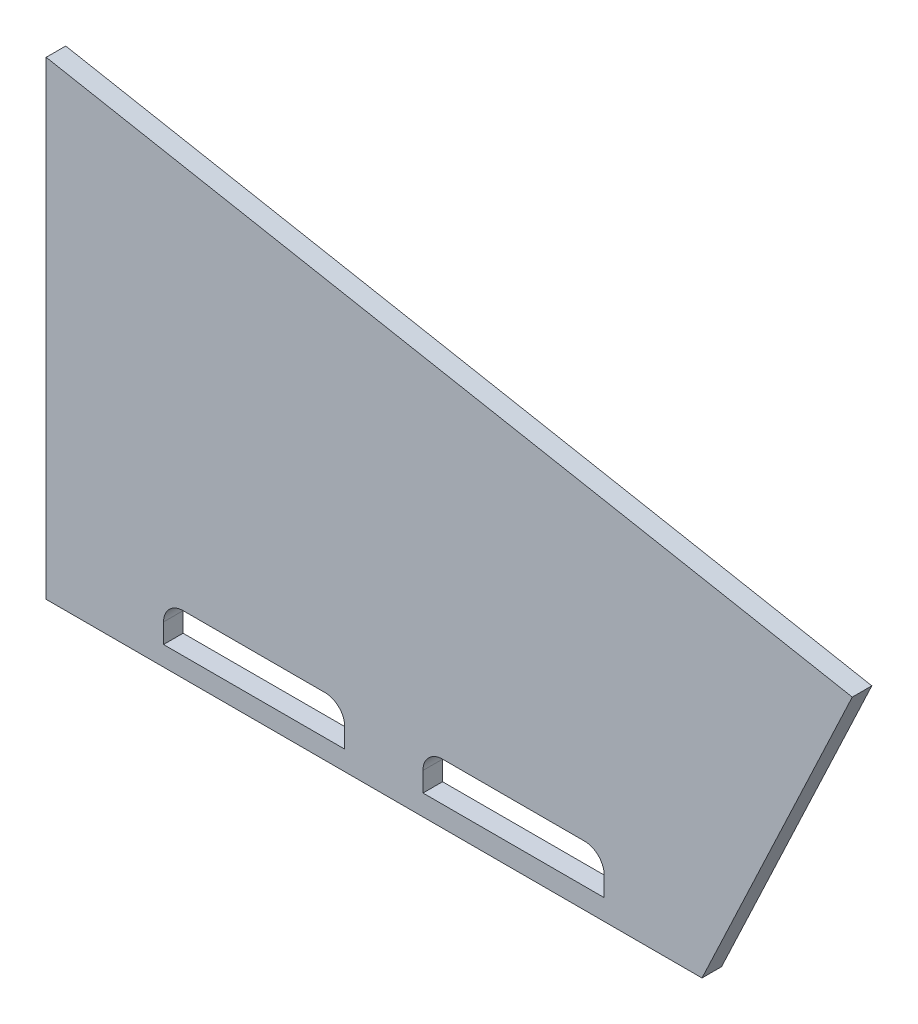
ISO-10303-21;
HEADER;
FILE_DESCRIPTION(('STEP AP214'),'2;1');
FILE_NAME('part.step','',(''),(''),'','','');
FILE_SCHEMA(('AUTOMOTIVE_DESIGN { 1 0 10303 214 1 1 1 1 }'));
ENDSEC;
DATA;
#1=APPLICATION_CONTEXT('core data for automotive mechanical design processes');
#2=APPLICATION_PROTOCOL_DEFINITION('international standard','automotive_design',2000,#1);
#3=PRODUCT_CONTEXT('',#1,'mechanical');
#4=PRODUCT('Part','Part','',(#3));
#5=PRODUCT_RELATED_PRODUCT_CATEGORY('part','',(#4));
#6=PRODUCT_DEFINITION_FORMATION('','',#4);
#7=PRODUCT_DEFINITION_CONTEXT('part definition',#1,'design');
#8=PRODUCT_DEFINITION('design','',#6,#7);
#9=PRODUCT_DEFINITION_SHAPE('','',#8);
#10=(LENGTH_UNIT() NAMED_UNIT(*) SI_UNIT(.MILLI.,.METRE.));
#11=(NAMED_UNIT(*) PLANE_ANGLE_UNIT() SI_UNIT($,.RADIAN.));
#12=(NAMED_UNIT(*) SI_UNIT($,.STERADIAN.) SOLID_ANGLE_UNIT());
#13=UNCERTAINTY_MEASURE_WITH_UNIT(LENGTH_MEASURE(1.E-05),#10,'distance_accuracy_value','');
#14=(GEOMETRIC_REPRESENTATION_CONTEXT(3) GLOBAL_UNCERTAINTY_ASSIGNED_CONTEXT((#13)) GLOBAL_UNIT_ASSIGNED_CONTEXT((#10,
#11,#12)) REPRESENTATION_CONTEXT('',''));
#15=CARTESIAN_POINT('',(0.,0.,0.));
#16=DIRECTION('',(0.,0.,1.));
#17=DIRECTION('',(1.,0.,0.));
#18=AXIS2_PLACEMENT_3D('',#15,#16,#17);
#19=CARTESIAN_POINT('',(12.7,22.225,-12.7));
#20=DIRECTION('',(0.,-1.,0.));
#21=DIRECTION('',(1.,0.,0.));
#22=AXIS2_PLACEMENT_3D('',#19,#20,#21);
#23=PLANE('',#22);
#24=DIRECTION('',(1.,0.,0.));
#25=VECTOR('',#24,1.);
#26=CARTESIAN_POINT('',(12.7,22.225,0.));
#27=LINE('',#26,#25);
#28=CARTESIAN_POINT('',(12.7,22.225,0.));
#29=VERTEX_POINT('',#28);
#30=CARTESIAN_POINT('',(438.521287640416,22.2250000000001,0.));
#31=VERTEX_POINT('',#30);
#32=EDGE_CURVE('E184',#29,#31,#27,.T.);
#33=ORIENTED_EDGE('',*,*,#32,.F.);
#34=DIRECTION('',(0.,0.,1.));
#35=VECTOR('',#34,1.);
#36=CARTESIAN_POINT('',(12.7,22.225,-12.7));
#37=LINE('',#36,#35);
#38=CARTESIAN_POINT('',(12.7,22.225,-12.7));
#39=VERTEX_POINT('',#38);
#40=EDGE_CURVE('E236',#39,#29,#37,.T.);
#41=ORIENTED_EDGE('',*,*,#40,.F.);
#42=DIRECTION('',(1.,0.,0.));
#43=VECTOR('',#42,1.);
#44=CARTESIAN_POINT('',(12.7,22.225,-12.7));
#45=LINE('',#44,#43);
#46=CARTESIAN_POINT('',(438.521287640416,22.2250000000001,-12.7));
#47=VERTEX_POINT('',#46);
#48=EDGE_CURVE('E212',#39,#47,#45,.T.);
#49=ORIENTED_EDGE('',*,*,#48,.T.);
#50=DIRECTION('',(0.,0.,1.));
#51=VECTOR('',#50,1.);
#52=CARTESIAN_POINT('',(438.521287640416,22.2250000000001,-12.7));
#53=LINE('',#52,#51);
#54=EDGE_CURVE('E225',#47,#31,#53,.T.);
#55=ORIENTED_EDGE('',*,*,#54,.T.);
#56=EDGE_LOOP('',(#33,#41,#49,#55));
#57=FACE_BOUND('',#56,.T.);
#58=ADVANCED_FACE('F37',(#57),#23,.T.);
#59=CARTESIAN_POINT('',(12.7,22.225,-12.7));
#60=DIRECTION('',(-1.,0.,0.));
#61=DIRECTION('',(0.,-1.,0.));
#62=AXIS2_PLACEMENT_3D('',#59,#60,#61);
#63=PLANE('',#62);
#64=DIRECTION('',(0.,-1.,0.));
#65=VECTOR('',#64,1.);
#66=CARTESIAN_POINT('',(12.7,22.225,0.));
#67=LINE('',#66,#65);
#68=CARTESIAN_POINT('',(12.7,327.024999999999,0.));
#69=VERTEX_POINT('',#68);
#70=EDGE_CURVE('E216',#69,#29,#67,.T.);
#71=ORIENTED_EDGE('',*,*,#70,.F.);
#72=DIRECTION('',(0.,0.,1.));
#73=VECTOR('',#72,1.);
#74=CARTESIAN_POINT('',(12.7,327.024999999999,-12.7));
#75=LINE('',#74,#73);
#76=CARTESIAN_POINT('',(12.7,327.024999999999,-12.7));
#77=VERTEX_POINT('',#76);
#78=EDGE_CURVE('E239',#77,#69,#75,.T.);
#79=ORIENTED_EDGE('',*,*,#78,.F.);
#80=DIRECTION('',(0.,-1.,0.));
#81=VECTOR('',#80,1.);
#82=CARTESIAN_POINT('',(12.7,22.225,-12.7));
#83=LINE('',#82,#81);
#84=EDGE_CURVE('E222',#77,#39,#83,.T.);
#85=ORIENTED_EDGE('',*,*,#84,.T.);
#86=ORIENTED_EDGE('',*,*,#40,.T.);
#87=EDGE_LOOP('',(#71,#79,#85,#86));
#88=FACE_BOUND('',#87,.T.);
#89=ADVANCED_FACE('F289',(#88),#63,.T.);
#90=CARTESIAN_POINT('',(12.7,327.024999999999,-12.7));
#91=DIRECTION('',(0.184164932559248,0.982895354356428,0.));
#92=DIRECTION('',(-0.982895354356428,0.184164932559248,0.));
#93=AXIS2_PLACEMENT_3D('',#90,#91,#92);
#94=PLANE('',#93);
#95=DIRECTION('',(-0.982895354356428,0.184164932559248,0.));
#96=VECTOR('',#95,1.);
#97=CARTESIAN_POINT('',(12.7,327.024999999999,0.));
#98=LINE('',#97,#96);
#99=CARTESIAN_POINT('',(536.089806584638,228.957542457714,0.));
#100=VERTEX_POINT('',#99);
#101=EDGE_CURVE('E231',#100,#69,#98,.T.);
#102=ORIENTED_EDGE('',*,*,#101,.F.);
#103=DIRECTION('',(0.,0.,1.));
#104=VECTOR('',#103,1.);
#105=CARTESIAN_POINT('',(536.089806584638,228.957542457714,-12.7));
#106=LINE('',#105,#104);
#107=CARTESIAN_POINT('',(536.089806584638,228.957542457714,-12.7));
#108=VERTEX_POINT('',#107);
#109=EDGE_CURVE('E241',#108,#100,#106,.T.);
#110=ORIENTED_EDGE('',*,*,#109,.F.);
#111=DIRECTION('',(-0.982895354356428,0.184164932559248,0.));
#112=VECTOR('',#111,1.);
#113=CARTESIAN_POINT('',(12.7,327.024999999999,-12.7));
#114=LINE('',#113,#112);
#115=EDGE_CURVE('E219',#108,#77,#114,.T.);
#116=ORIENTED_EDGE('',*,*,#115,.T.);
#117=ORIENTED_EDGE('',*,*,#78,.T.);
#118=EDGE_LOOP('',(#102,#110,#116,#117));
#119=FACE_BOUND('',#118,.T.);
#120=ADVANCED_FACE('F295',(#119),#94,.T.);
#121=CARTESIAN_POINT('',(438.521287640416,22.2250000000001,-12.7));
#122=DIRECTION('',(0.904341830523688,-0.426808919266064,0.));
#123=DIRECTION('',(0.426808919266064,0.904341830523688,0.));
#124=AXIS2_PLACEMENT_3D('',#121,#122,#123);
#125=PLANE('',#124);
#126=DIRECTION('',(0.426808919266064,0.904341830523688,0.));
#127=VECTOR('',#126,1.);
#128=CARTESIAN_POINT('',(438.521287640416,22.2250000000001,0.));
#129=LINE('',#128,#127);
#130=EDGE_CURVE('E228',#31,#100,#129,.T.);
#131=ORIENTED_EDGE('',*,*,#130,.F.);
#132=ORIENTED_EDGE('',*,*,#54,.F.);
#133=DIRECTION('',(0.426808919266064,0.904341830523688,0.));
#134=VECTOR('',#133,1.);
#135=CARTESIAN_POINT('',(438.521287640416,22.2250000000001,-12.7));
#136=LINE('',#135,#134);
#137=EDGE_CURVE('E215',#47,#108,#136,.T.);
#138=ORIENTED_EDGE('',*,*,#137,.T.);
#139=ORIENTED_EDGE('',*,*,#109,.T.);
#140=EDGE_LOOP('',(#131,#132,#138,#139));
#141=FACE_BOUND('',#140,.T.);
#142=ADVANCED_FACE('F301',(#141),#125,.T.);
#143=CARTESIAN_POINT('',(0.,0.,-12.7));
#144=DIRECTION('',(0.,0.,1.));
#145=DIRECTION('',(1.,0.,0.));
#146=AXIS2_PLACEMENT_3D('',#143,#144,#145);
#147=PLANE('',#146);
#148=DIRECTION('',(0.,1.,0.));
#149=VECTOR('',#148,1.);
#150=CARTESIAN_POINT('',(206.560643820208,34.925,-12.7));
#151=LINE('',#150,#149);
#152=CARTESIAN_POINT('',(206.560643820208,34.925,-12.7));
#153=VERTEX_POINT('',#152);
#154=CARTESIAN_POINT('',(206.560643820208,47.625,-12.7));
#155=VERTEX_POINT('',#154);
#156=EDGE_CURVE('E170',#153,#155,#151,.T.);
#157=ORIENTED_EDGE('',*,*,#156,.T.);
#158=CARTESIAN_POINT('',(193.860643820208,47.625,-12.7));
#159=DIRECTION('',(0.,0.,1.));
#160=DIRECTION('',(1.,0.,0.));
#161=AXIS2_PLACEMENT_3D('',#158,#159,#160);
#162=CIRCLE('',#161,12.7);
#163=CARTESIAN_POINT('',(193.860643820208,60.325,-12.7));
#164=VERTEX_POINT('',#163);
#165=EDGE_CURVE('E272',#155,#164,#162,.T.);
#166=ORIENTED_EDGE('',*,*,#165,.T.);
#167=DIRECTION('',(-1.,0.,0.));
#168=VECTOR('',#167,1.);
#169=CARTESIAN_POINT('',(88.9,60.325,-12.7));
#170=LINE('',#169,#168);
#171=CARTESIAN_POINT('',(101.6,60.325,-12.7));
#172=VERTEX_POINT('',#171);
#173=EDGE_CURVE('E166',#164,#172,#170,.T.);
#174=ORIENTED_EDGE('',*,*,#173,.T.);
#175=CARTESIAN_POINT('',(101.6,47.625,-12.7));
#176=DIRECTION('',(0.,0.,1.));
#177=DIRECTION('',(1.,0.,0.));
#178=AXIS2_PLACEMENT_3D('',#175,#176,#177);
#179=CIRCLE('',#178,12.7);
#180=CARTESIAN_POINT('',(88.9,47.625,-12.7));
#181=VERTEX_POINT('',#180);
#182=EDGE_CURVE('E11',#172,#181,#179,.T.);
#183=ORIENTED_EDGE('',*,*,#182,.T.);
#184=DIRECTION('',(0.,-1.,0.));
#185=VECTOR('',#184,1.);
#186=CARTESIAN_POINT('',(88.9,34.925,-12.7));
#187=LINE('',#186,#185);
#188=CARTESIAN_POINT('',(88.9,34.925,-12.7));
#189=VERTEX_POINT('',#188);
#190=EDGE_CURVE('E147',#181,#189,#187,.T.);
#191=ORIENTED_EDGE('',*,*,#190,.T.);
#192=DIRECTION('',(1.,0.,0.));
#193=VECTOR('',#192,1.);
#194=CARTESIAN_POINT('',(88.9,34.925,-12.7));
#195=LINE('',#194,#193);
#196=EDGE_CURVE('E153',#189,#153,#195,.T.);
#197=ORIENTED_EDGE('',*,*,#196,.T.);
#198=EDGE_LOOP('',(#157,#166,#174,#183,#191,#197));
#199=FACE_BOUND('',#198,.T.);
#200=DIRECTION('',(0.,1.,0.));
#201=VECTOR('',#200,1.);
#202=CARTESIAN_POINT('',(375.021287640416,35.6556871069854,-12.7));
#203=LINE('',#202,#201);
#204=CARTESIAN_POINT('',(375.021287640416,35.6556871069854,-12.7));
#205=VERTEX_POINT('',#204);
#206=CARTESIAN_POINT('',(375.021287640416,48.3556871069854,-12.7));
#207=VERTEX_POINT('',#206);
#208=EDGE_CURVE('E205',#205,#207,#203,.T.);
#209=ORIENTED_EDGE('',*,*,#208,.T.);
#210=CARTESIAN_POINT('',(362.321287640416,48.3556871069854,-12.7));
#211=DIRECTION('',(0.,0.,1.));
#212=DIRECTION('',(1.,0.,0.));
#213=AXIS2_PLACEMENT_3D('',#210,#211,#212);
#214=CIRCLE('',#213,12.7);
#215=CARTESIAN_POINT('',(362.321287640416,61.0556871069854,-12.7));
#216=VERTEX_POINT('',#215);
#217=EDGE_CURVE('E264',#207,#216,#214,.T.);
#218=ORIENTED_EDGE('',*,*,#217,.T.);
#219=DIRECTION('',(-1.,0.,0.));
#220=VECTOR('',#219,1.);
#221=CARTESIAN_POINT('',(257.360643820208,61.0556871069854,-12.7));
#222=LINE('',#221,#220);
#223=CARTESIAN_POINT('',(270.060643820208,61.0556871069854,-12.7));
#224=VERTEX_POINT('',#223);
#225=EDGE_CURVE('E189',#216,#224,#222,.T.);
#226=ORIENTED_EDGE('',*,*,#225,.T.);
#227=CARTESIAN_POINT('',(270.060643820208,48.3556871069854,-12.7));
#228=DIRECTION('',(0.,0.,1.));
#229=DIRECTION('',(1.,0.,0.));
#230=AXIS2_PLACEMENT_3D('',#227,#228,#229);
#231=CIRCLE('',#230,12.7);
#232=CARTESIAN_POINT('',(257.360643820208,48.3556871069854,-12.7));
#233=VERTEX_POINT('',#232);
#234=EDGE_CURVE('E268',#224,#233,#231,.T.);
#235=ORIENTED_EDGE('',*,*,#234,.T.);
#236=DIRECTION('',(0.,-1.,0.));
#237=VECTOR('',#236,1.);
#238=CARTESIAN_POINT('',(257.360643820208,35.6556871069854,-12.7));
#239=LINE('',#238,#237);
#240=CARTESIAN_POINT('',(257.360643820208,35.6556871069854,-12.7));
#241=VERTEX_POINT('',#240);
#242=EDGE_CURVE('E196',#233,#241,#239,.T.);
#243=ORIENTED_EDGE('',*,*,#242,.T.);
#244=DIRECTION('',(1.,0.,0.));
#245=VECTOR('',#244,1.);
#246=CARTESIAN_POINT('',(257.360643820208,35.6556871069854,-12.7));
#247=LINE('',#246,#245);
#248=EDGE_CURVE('E208',#241,#205,#247,.T.);
#249=ORIENTED_EDGE('',*,*,#248,.T.);
#250=EDGE_LOOP('',(#209,#218,#226,#235,#243,#249));
#251=FACE_BOUND('',#250,.T.);
#252=ORIENTED_EDGE('',*,*,#48,.F.);
#253=ORIENTED_EDGE('',*,*,#84,.F.);
#254=ORIENTED_EDGE('',*,*,#115,.F.);
#255=ORIENTED_EDGE('',*,*,#137,.F.);
#256=EDGE_LOOP('',(#252,#253,#254,#255));
#257=FACE_BOUND('',#256,.T.);
#258=ADVANCED_FACE('F150',(#199,#251,#257),#147,.F.);
#259=CARTESIAN_POINT('',(0.,0.,0.));
#260=DIRECTION('',(0.,0.,1.));
#261=DIRECTION('',(1.,0.,0.));
#262=AXIS2_PLACEMENT_3D('',#259,#260,#261);
#263=PLANE('',#262);
#264=DIRECTION('',(0.,-1.,0.));
#265=VECTOR('',#264,1.);
#266=CARTESIAN_POINT('',(88.9,34.925,0.));
#267=LINE('',#266,#265);
#268=CARTESIAN_POINT('',(88.9,47.625,0.));
#269=VERTEX_POINT('',#268);
#270=CARTESIAN_POINT('',(88.9,34.925,0.));
#271=VERTEX_POINT('',#270);
#272=EDGE_CURVE('E161',#269,#271,#267,.T.);
#273=ORIENTED_EDGE('',*,*,#272,.F.);
#274=CARTESIAN_POINT('',(101.6,47.625,0.));
#275=DIRECTION('',(0.,0.,1.));
#276=DIRECTION('',(1.,0.,0.));
#277=AXIS2_PLACEMENT_3D('',#274,#275,#276);
#278=CIRCLE('',#277,12.7);
#279=CARTESIAN_POINT('',(101.6,60.325,0.));
#280=VERTEX_POINT('',#279);
#281=EDGE_CURVE('E45',#269,#280,#278,.F.);
#282=ORIENTED_EDGE('',*,*,#281,.T.);
#283=DIRECTION('',(-1.,0.,0.));
#284=VECTOR('',#283,1.);
#285=CARTESIAN_POINT('',(88.9,60.325,0.));
#286=LINE('',#285,#284);
#287=CARTESIAN_POINT('',(193.860643820208,60.325,0.));
#288=VERTEX_POINT('',#287);
#289=EDGE_CURVE('E155',#288,#280,#286,.T.);
#290=ORIENTED_EDGE('',*,*,#289,.F.);
#291=CARTESIAN_POINT('',(193.860643820208,47.625,0.));
#292=DIRECTION('',(0.,0.,1.));
#293=DIRECTION('',(1.,0.,0.));
#294=AXIS2_PLACEMENT_3D('',#291,#292,#293);
#295=CIRCLE('',#294,12.7);
#296=CARTESIAN_POINT('',(206.560643820208,47.625,0.));
#297=VERTEX_POINT('',#296);
#298=EDGE_CURVE('E270',#288,#297,#295,.F.);
#299=ORIENTED_EDGE('',*,*,#298,.T.);
#300=DIRECTION('',(0.,1.,0.));
#301=VECTOR('',#300,1.);
#302=CARTESIAN_POINT('',(206.560643820208,34.925,0.));
#303=LINE('',#302,#301);
#304=CARTESIAN_POINT('',(206.560643820208,34.925,0.));
#305=VERTEX_POINT('',#304);
#306=EDGE_CURVE('E179',#305,#297,#303,.T.);
#307=ORIENTED_EDGE('',*,*,#306,.F.);
#308=DIRECTION('',(1.,0.,0.));
#309=VECTOR('',#308,1.);
#310=CARTESIAN_POINT('',(88.9,34.925,0.));
#311=LINE('',#310,#309);
#312=EDGE_CURVE('E176',#271,#305,#311,.T.);
#313=ORIENTED_EDGE('',*,*,#312,.F.);
#314=EDGE_LOOP('',(#273,#282,#290,#299,#307,#313));
#315=FACE_BOUND('',#314,.T.);
#316=DIRECTION('',(0.,-1.,0.));
#317=VECTOR('',#316,1.);
#318=CARTESIAN_POINT('',(257.360643820208,35.6556871069854,0.));
#319=LINE('',#318,#317);
#320=CARTESIAN_POINT('',(257.360643820208,48.3556871069854,0.));
#321=VERTEX_POINT('',#320);
#322=CARTESIAN_POINT('',(257.360643820208,35.6556871069854,0.));
#323=VERTEX_POINT('',#322);
#324=EDGE_CURVE('E177',#321,#323,#319,.T.);
#325=ORIENTED_EDGE('',*,*,#324,.F.);
#326=CARTESIAN_POINT('',(270.060643820208,48.3556871069854,0.));
#327=DIRECTION('',(0.,0.,1.));
#328=DIRECTION('',(1.,0.,0.));
#329=AXIS2_PLACEMENT_3D('',#326,#327,#328);
#330=CIRCLE('',#329,12.7);
#331=CARTESIAN_POINT('',(270.060643820208,61.0556871069854,0.));
#332=VERTEX_POINT('',#331);
#333=EDGE_CURVE('E266',#321,#332,#330,.F.);
#334=ORIENTED_EDGE('',*,*,#333,.T.);
#335=DIRECTION('',(-1.,0.,0.));
#336=VECTOR('',#335,1.);
#337=CARTESIAN_POINT('',(257.360643820208,61.0556871069854,0.));
#338=LINE('',#337,#336);
#339=CARTESIAN_POINT('',(362.321287640416,61.0556871069854,0.));
#340=VERTEX_POINT('',#339);
#341=EDGE_CURVE('E192',#340,#332,#338,.T.);
#342=ORIENTED_EDGE('',*,*,#341,.F.);
#343=CARTESIAN_POINT('',(362.321287640416,48.3556871069854,0.));
#344=DIRECTION('',(0.,0.,1.));
#345=DIRECTION('',(1.,0.,0.));
#346=AXIS2_PLACEMENT_3D('',#343,#344,#345);
#347=CIRCLE('',#346,12.7);
#348=CARTESIAN_POINT('',(375.021287640416,48.3556871069854,0.));
#349=VERTEX_POINT('',#348);
#350=EDGE_CURVE('E262',#340,#349,#347,.F.);
#351=ORIENTED_EDGE('',*,*,#350,.T.);
#352=DIRECTION('',(0.,1.,0.));
#353=VECTOR('',#352,1.);
#354=CARTESIAN_POINT('',(375.021287640416,35.6556871069854,0.));
#355=LINE('',#354,#353);
#356=CARTESIAN_POINT('',(375.021287640416,35.6556871069854,0.));
#357=VERTEX_POINT('',#356);
#358=EDGE_CURVE('E195',#357,#349,#355,.T.);
#359=ORIENTED_EDGE('',*,*,#358,.F.);
#360=DIRECTION('',(1.,0.,0.));
#361=VECTOR('',#360,1.);
#362=CARTESIAN_POINT('',(257.360643820208,35.6556871069854,0.));
#363=LINE('',#362,#361);
#364=EDGE_CURVE('E199',#323,#357,#363,.T.);
#365=ORIENTED_EDGE('',*,*,#364,.F.);
#366=EDGE_LOOP('',(#325,#334,#342,#351,#359,#365));
#367=FACE_BOUND('',#366,.T.);
#368=ORIENTED_EDGE('',*,*,#32,.T.);
#369=ORIENTED_EDGE('',*,*,#130,.T.);
#370=ORIENTED_EDGE('',*,*,#101,.T.);
#371=ORIENTED_EDGE('',*,*,#70,.T.);
#372=EDGE_LOOP('',(#368,#369,#370,#371));
#373=FACE_BOUND('',#372,.T.);
#374=ADVANCED_FACE('F275',(#315,#367,#373),#263,.T.);
#375=CARTESIAN_POINT('',(257.360643820208,35.6556871069854,-12.7));
#376=DIRECTION('',(-1.,0.,0.));
#377=DIRECTION('',(0.,0.,1.));
#378=AXIS2_PLACEMENT_3D('',#375,#376,#377);
#379=PLANE('',#378);
#380=ORIENTED_EDGE('',*,*,#242,.F.);
#381=DIRECTION('',(0.,0.,1.));
#382=VECTOR('',#381,1.);
#383=CARTESIAN_POINT('',(257.360643820208,48.3556871069854,0.));
#384=LINE('',#383,#382);
#385=EDGE_CURVE('E250',#233,#321,#384,.T.);
#386=ORIENTED_EDGE('',*,*,#385,.T.);
#387=ORIENTED_EDGE('',*,*,#324,.T.);
#388=DIRECTION('',(0.,0.,1.));
#389=VECTOR('',#388,1.);
#390=CARTESIAN_POINT('',(257.360643820208,35.6556871069854,-12.7));
#391=LINE('',#390,#389);
#392=EDGE_CURVE('E186',#241,#323,#391,.T.);
#393=ORIENTED_EDGE('',*,*,#392,.F.);
#394=EDGE_LOOP('',(#380,#386,#387,#393));
#395=FACE_BOUND('',#394,.T.);
#396=ADVANCED_FACE('F319',(#395),#379,.F.);
#397=CARTESIAN_POINT('',(257.360643820208,61.0556871069854,-12.7));
#398=DIRECTION('',(0.,1.,0.));
#399=DIRECTION('',(0.,0.,1.));
#400=AXIS2_PLACEMENT_3D('',#397,#398,#399);
#401=PLANE('',#400);
#402=ORIENTED_EDGE('',*,*,#225,.F.);
#403=DIRECTION('',(0.,0.,1.));
#404=VECTOR('',#403,1.);
#405=CARTESIAN_POINT('',(362.321287640416,61.0556871069854,0.));
#406=LINE('',#405,#404);
#407=EDGE_CURVE('E245',#216,#340,#406,.T.);
#408=ORIENTED_EDGE('',*,*,#407,.T.);
#409=ORIENTED_EDGE('',*,*,#341,.T.);
#410=DIRECTION('',(0.,0.,1.));
#411=VECTOR('',#410,1.);
#412=CARTESIAN_POINT('',(270.060643820208,61.0556871069854,-12.7));
#413=LINE('',#412,#411);
#414=EDGE_CURVE('E238',#332,#224,#413,.F.);
#415=ORIENTED_EDGE('',*,*,#414,.T.);
#416=EDGE_LOOP('',(#402,#408,#409,#415));
#417=FACE_BOUND('',#416,.T.);
#418=ADVANCED_FACE('F332',(#417),#401,.F.);
#419=CARTESIAN_POINT('',(375.021287640416,35.6556871069854,-12.7));
#420=DIRECTION('',(1.,0.,0.));
#421=DIRECTION('',(0.,0.,-1.));
#422=AXIS2_PLACEMENT_3D('',#419,#420,#421);
#423=PLANE('',#422);
#424=ORIENTED_EDGE('',*,*,#358,.T.);
#425=DIRECTION('',(0.,0.,1.));
#426=VECTOR('',#425,1.);
#427=CARTESIAN_POINT('',(375.021287640416,48.3556871069854,-12.7));
#428=LINE('',#427,#426);
#429=EDGE_CURVE('E248',#349,#207,#428,.F.);
#430=ORIENTED_EDGE('',*,*,#429,.T.);
#431=ORIENTED_EDGE('',*,*,#208,.F.);
#432=DIRECTION('',(0.,0.,1.));
#433=VECTOR('',#432,1.);
#434=CARTESIAN_POINT('',(375.021287640416,35.6556871069854,-12.7));
#435=LINE('',#434,#433);
#436=EDGE_CURVE('E190',#205,#357,#435,.T.);
#437=ORIENTED_EDGE('',*,*,#436,.T.);
#438=EDGE_LOOP('',(#424,#430,#431,#437));
#439=FACE_BOUND('',#438,.T.);
#440=ADVANCED_FACE('F335',(#439),#423,.F.);
#441=CARTESIAN_POINT('',(257.360643820208,35.6556871069854,-12.7));
#442=DIRECTION('',(0.,-1.,0.));
#443=DIRECTION('',(0.,0.,-1.));
#444=AXIS2_PLACEMENT_3D('',#441,#442,#443);
#445=PLANE('',#444);
#446=ORIENTED_EDGE('',*,*,#364,.T.);
#447=ORIENTED_EDGE('',*,*,#436,.F.);
#448=ORIENTED_EDGE('',*,*,#248,.F.);
#449=ORIENTED_EDGE('',*,*,#392,.T.);
#450=EDGE_LOOP('',(#446,#447,#448,#449));
#451=FACE_BOUND('',#450,.T.);
#452=ADVANCED_FACE('F325',(#451),#445,.F.);
#453=CARTESIAN_POINT('',(88.9,34.925,-12.7));
#454=DIRECTION('',(-1.,0.,0.));
#455=DIRECTION('',(0.,0.,1.));
#456=AXIS2_PLACEMENT_3D('',#453,#454,#455);
#457=PLANE('',#456);
#458=ORIENTED_EDGE('',*,*,#190,.F.);
#459=DIRECTION('',(0.,0.,1.));
#460=VECTOR('',#459,1.);
#461=CARTESIAN_POINT('',(88.9,47.625,0.));
#462=LINE('',#461,#460);
#463=EDGE_CURVE('E260',#181,#269,#462,.T.);
#464=ORIENTED_EDGE('',*,*,#463,.T.);
#465=ORIENTED_EDGE('',*,*,#272,.T.);
#466=DIRECTION('',(0.,0.,1.));
#467=VECTOR('',#466,1.);
#468=CARTESIAN_POINT('',(88.9,34.925,-12.7));
#469=LINE('',#468,#467);
#470=EDGE_CURVE('E158',#189,#271,#469,.T.);
#471=ORIENTED_EDGE('',*,*,#470,.F.);
#472=EDGE_LOOP('',(#458,#464,#465,#471));
#473=FACE_BOUND('',#472,.T.);
#474=ADVANCED_FACE('F159',(#473),#457,.F.);
#475=CARTESIAN_POINT('',(88.9,60.325,-12.7));
#476=DIRECTION('',(0.,1.,0.));
#477=DIRECTION('',(0.,0.,1.));
#478=AXIS2_PLACEMENT_3D('',#475,#476,#477);
#479=PLANE('',#478);
#480=ORIENTED_EDGE('',*,*,#173,.F.);
#481=DIRECTION('',(0.,0.,1.));
#482=VECTOR('',#481,1.);
#483=CARTESIAN_POINT('',(193.860643820208,60.325,0.));
#484=LINE('',#483,#482);
#485=EDGE_CURVE('E255',#164,#288,#484,.T.);
#486=ORIENTED_EDGE('',*,*,#485,.T.);
#487=ORIENTED_EDGE('',*,*,#289,.T.);
#488=DIRECTION('',(0.,0.,1.));
#489=VECTOR('',#488,1.);
#490=CARTESIAN_POINT('',(101.6,60.325,-12.7));
#491=LINE('',#490,#489);
#492=EDGE_CURVE('E253',#280,#172,#491,.F.);
#493=ORIENTED_EDGE('',*,*,#492,.T.);
#494=EDGE_LOOP('',(#480,#486,#487,#493));
#495=FACE_BOUND('',#494,.T.);
#496=ADVANCED_FACE('F279',(#495),#479,.F.);
#497=CARTESIAN_POINT('',(206.560643820208,34.925,-12.7));
#498=DIRECTION('',(1.,0.,0.));
#499=DIRECTION('',(0.,0.,-1.));
#500=AXIS2_PLACEMENT_3D('',#497,#498,#499);
#501=PLANE('',#500);
#502=ORIENTED_EDGE('',*,*,#306,.T.);
#503=DIRECTION('',(0.,0.,1.));
#504=VECTOR('',#503,1.);
#505=CARTESIAN_POINT('',(206.560643820208,47.625,-12.7));
#506=LINE('',#505,#504);
#507=EDGE_CURVE('E258',#297,#155,#506,.F.);
#508=ORIENTED_EDGE('',*,*,#507,.T.);
#509=ORIENTED_EDGE('',*,*,#156,.F.);
#510=DIRECTION('',(0.,0.,1.));
#511=VECTOR('',#510,1.);
#512=CARTESIAN_POINT('',(206.560643820208,34.925,-12.7));
#513=LINE('',#512,#511);
#514=EDGE_CURVE('E165',#153,#305,#513,.T.);
#515=ORIENTED_EDGE('',*,*,#514,.T.);
#516=EDGE_LOOP('',(#502,#508,#509,#515));
#517=FACE_BOUND('',#516,.T.);
#518=ADVANCED_FACE('F414',(#517),#501,.F.);
#519=CARTESIAN_POINT('',(88.9,34.925,-12.7));
#520=DIRECTION('',(0.,-1.,0.));
#521=DIRECTION('',(0.,0.,-1.));
#522=AXIS2_PLACEMENT_3D('',#519,#520,#521);
#523=PLANE('',#522);
#524=ORIENTED_EDGE('',*,*,#312,.T.);
#525=ORIENTED_EDGE('',*,*,#514,.F.);
#526=ORIENTED_EDGE('',*,*,#196,.F.);
#527=ORIENTED_EDGE('',*,*,#470,.T.);
#528=EDGE_LOOP('',(#524,#525,#526,#527));
#529=FACE_BOUND('',#528,.T.);
#530=ADVANCED_FACE('F169',(#529),#523,.F.);
#531=CARTESIAN_POINT('',(362.321287640416,48.3556871069854,-12.7));
#532=DIRECTION('',(0.,0.,-1.));
#533=DIRECTION('',(-1.,0.,0.));
#534=AXIS2_PLACEMENT_3D('',#531,#532,#533);
#535=CYLINDRICAL_SURFACE('',#534,12.7);
#536=ORIENTED_EDGE('',*,*,#217,.F.);
#537=ORIENTED_EDGE('',*,*,#429,.F.);
#538=ORIENTED_EDGE('',*,*,#350,.F.);
#539=ORIENTED_EDGE('',*,*,#407,.F.);
#540=EDGE_LOOP('',(#536,#537,#538,#539));
#541=FACE_BOUND('',#540,.T.);
#542=ADVANCED_FACE('F303',(#541),#535,.F.);
#543=CARTESIAN_POINT('',(270.060643820208,48.3556871069854,-12.7));
#544=DIRECTION('',(0.,0.,-1.));
#545=DIRECTION('',(-1.,0.,0.));
#546=AXIS2_PLACEMENT_3D('',#543,#544,#545);
#547=CYLINDRICAL_SURFACE('',#546,12.7);
#548=ORIENTED_EDGE('',*,*,#234,.F.);
#549=ORIENTED_EDGE('',*,*,#414,.F.);
#550=ORIENTED_EDGE('',*,*,#333,.F.);
#551=ORIENTED_EDGE('',*,*,#385,.F.);
#552=EDGE_LOOP('',(#548,#549,#550,#551));
#553=FACE_BOUND('',#552,.T.);
#554=ADVANCED_FACE('F286',(#553),#547,.F.);
#555=CARTESIAN_POINT('',(193.860643820208,47.625,-12.7));
#556=DIRECTION('',(0.,0.,-1.));
#557=DIRECTION('',(-1.,0.,0.));
#558=AXIS2_PLACEMENT_3D('',#555,#556,#557);
#559=CYLINDRICAL_SURFACE('',#558,12.7);
#560=ORIENTED_EDGE('',*,*,#165,.F.);
#561=ORIENTED_EDGE('',*,*,#507,.F.);
#562=ORIENTED_EDGE('',*,*,#298,.F.);
#563=ORIENTED_EDGE('',*,*,#485,.F.);
#564=EDGE_LOOP('',(#560,#561,#562,#563));
#565=FACE_BOUND('',#564,.T.);
#566=ADVANCED_FACE('F282',(#565),#559,.F.);
#567=CARTESIAN_POINT('',(101.6,47.625,-12.7));
#568=DIRECTION('',(0.,0.,-1.));
#569=DIRECTION('',(-1.,0.,0.));
#570=AXIS2_PLACEMENT_3D('',#567,#568,#569);
#571=CYLINDRICAL_SURFACE('',#570,12.7);
#572=ORIENTED_EDGE('',*,*,#182,.F.);
#573=ORIENTED_EDGE('',*,*,#492,.F.);
#574=ORIENTED_EDGE('',*,*,#281,.F.);
#575=ORIENTED_EDGE('',*,*,#463,.F.);
#576=EDGE_LOOP('',(#572,#573,#574,#575));
#577=FACE_BOUND('',#576,.T.);
#578=ADVANCED_FACE('F39',(#577),#571,.F.);
#579=CLOSED_SHELL('',(#58,#89,#120,#142,#258,#374,#396,#418,#440,#452,#474,#496,#518,#530,#542,
#554,#566,#578));
#580=MANIFOLD_SOLID_BREP('B2',#579);
#581=ADVANCED_BREP_SHAPE_REPRESENTATION('',(#18,#580),#14);
#582=SHAPE_DEFINITION_REPRESENTATION(#9,#581);
ENDSEC;
END-ISO-10303-21;
